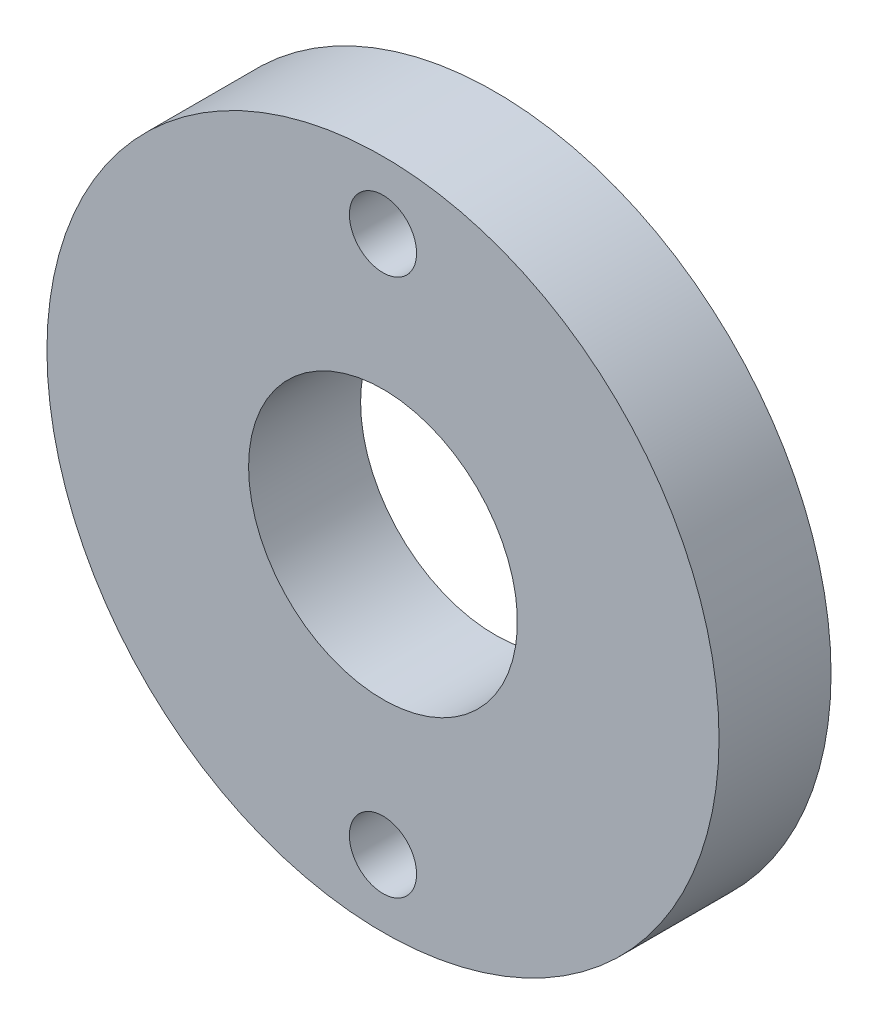
ISO-10303-21;
HEADER;
FILE_DESCRIPTION(('STEP AP214'),'2;1');
FILE_NAME('part.step','',(''),(''),'','','');
FILE_SCHEMA(('AUTOMOTIVE_DESIGN { 1 0 10303 214 1 1 1 1 }'));
ENDSEC;
DATA;
#1=APPLICATION_CONTEXT('core data for automotive mechanical design processes');
#2=APPLICATION_PROTOCOL_DEFINITION('international standard','automotive_design',2000,#1);
#3=PRODUCT_CONTEXT('',#1,'mechanical');
#4=PRODUCT('Part','Part','',(#3));
#5=PRODUCT_RELATED_PRODUCT_CATEGORY('part','',(#4));
#6=PRODUCT_DEFINITION_FORMATION('','',#4);
#7=PRODUCT_DEFINITION_CONTEXT('part definition',#1,'design');
#8=PRODUCT_DEFINITION('design','',#6,#7);
#9=PRODUCT_DEFINITION_SHAPE('','',#8);
#10=(LENGTH_UNIT() NAMED_UNIT(*) SI_UNIT(.MILLI.,.METRE.));
#11=(NAMED_UNIT(*) PLANE_ANGLE_UNIT() SI_UNIT($,.RADIAN.));
#12=(NAMED_UNIT(*) SI_UNIT($,.STERADIAN.) SOLID_ANGLE_UNIT());
#13=UNCERTAINTY_MEASURE_WITH_UNIT(LENGTH_MEASURE(1.E-05),#10,'distance_accuracy_value','');
#14=(GEOMETRIC_REPRESENTATION_CONTEXT(3) GLOBAL_UNCERTAINTY_ASSIGNED_CONTEXT((#13)) GLOBAL_UNIT_ASSIGNED_CONTEXT((#10,
#11,#12)) REPRESENTATION_CONTEXT('',''));
#15=CARTESIAN_POINT('',(0.,0.,0.));
#16=DIRECTION('',(0.,0.,1.));
#17=DIRECTION('',(1.,0.,0.));
#18=AXIS2_PLACEMENT_3D('',#15,#16,#17);
#19=CARTESIAN_POINT('',(259.301545348096,-148.573704322227,-5.00000000000002));
#20=DIRECTION('',(0.,0.,-1.));
#21=DIRECTION('',(-1.,0.,0.));
#22=AXIS2_PLACEMENT_3D('',#19,#20,#21);
#23=PLANE('',#22);
#24=CARTESIAN_POINT('',(259.301545348096,-136.573704322227,-5.00000000000002));
#25=DIRECTION('',(0.,0.,-1.));
#26=DIRECTION('',(-1.,0.,0.));
#27=AXIS2_PLACEMENT_3D('',#24,#25,#26);
#28=CIRCLE('',#27,1.50000000000002);
#29=CARTESIAN_POINT('',(257.801545348096,-136.573704322227,-5.00000000000002));
#30=VERTEX_POINT('',#29);
#31=EDGE_CURVE('E56',#30,#30,#28,.T.);
#32=ORIENTED_EDGE('',*,*,#31,.F.);
#33=EDGE_LOOP('',(#32));
#34=FACE_BOUND('',#33,.T.);
#35=CARTESIAN_POINT('',(259.301545348096,-148.573704322227,-5.00000000000002));
#36=DIRECTION('',(0.,0.,-1.));
#37=DIRECTION('',(-1.,0.,0.));
#38=AXIS2_PLACEMENT_3D('',#35,#36,#37);
#39=CIRCLE('',#38,15.);
#40=CARTESIAN_POINT('',(244.301545348096,-148.573704322227,-5.00000000000002));
#41=VERTEX_POINT('',#40);
#42=EDGE_CURVE('E10',#41,#41,#39,.T.);
#43=ORIENTED_EDGE('',*,*,#42,.T.);
#44=EDGE_LOOP('',(#43));
#45=FACE_BOUND('',#44,.T.);
#46=CARTESIAN_POINT('',(259.301545348096,-148.573704322227,-5.00000000000002));
#47=DIRECTION('',(0.,0.,-1.));
#48=DIRECTION('',(-1.,0.,0.));
#49=AXIS2_PLACEMENT_3D('',#46,#47,#48);
#50=CIRCLE('',#49,5.99999999999999);
#51=CARTESIAN_POINT('',(253.301545348096,-148.573704322227,-5.00000000000002));
#52=VERTEX_POINT('',#51);
#53=EDGE_CURVE('E50',#52,#52,#50,.T.);
#54=ORIENTED_EDGE('',*,*,#53,.F.);
#55=EDGE_LOOP('',(#54));
#56=FACE_BOUND('',#55,.T.);
#57=CARTESIAN_POINT('',(259.301545348096,-160.573704322227,-5.00000000000002));
#58=DIRECTION('',(0.,0.,-1.));
#59=DIRECTION('',(-1.,0.,0.));
#60=AXIS2_PLACEMENT_3D('',#57,#58,#59);
#61=CIRCLE('',#60,1.50000000000002);
#62=CARTESIAN_POINT('',(257.801545348096,-160.573704322227,-5.00000000000002));
#63=VERTEX_POINT('',#62);
#64=EDGE_CURVE('E64',#63,#63,#61,.T.);
#65=ORIENTED_EDGE('',*,*,#64,.F.);
#66=EDGE_LOOP('',(#65));
#67=FACE_BOUND('',#66,.T.);
#68=ADVANCED_FACE('F37',(#34,#45,#56,#67),#23,.T.);
#69=CARTESIAN_POINT('',(259.301545348096,-148.573704322227,0.));
#70=DIRECTION('',(0.,0.,-1.));
#71=DIRECTION('',(-1.,0.,0.));
#72=AXIS2_PLACEMENT_3D('',#69,#70,#71);
#73=PLANE('',#72);
#74=CARTESIAN_POINT('',(259.301545348096,-148.573704322227,0.));
#75=DIRECTION('',(0.,0.,-1.));
#76=DIRECTION('',(-1.,0.,0.));
#77=AXIS2_PLACEMENT_3D('',#74,#75,#76);
#78=CIRCLE('',#77,15.);
#79=CARTESIAN_POINT('',(244.301545348096,-148.573704322227,0.));
#80=VERTEX_POINT('',#79);
#81=EDGE_CURVE('E41',#80,#80,#78,.T.);
#82=ORIENTED_EDGE('',*,*,#81,.F.);
#83=EDGE_LOOP('',(#82));
#84=FACE_BOUND('',#83,.T.);
#85=CARTESIAN_POINT('',(259.301545348096,-148.573704322227,0.));
#86=DIRECTION('',(0.,0.,-1.));
#87=DIRECTION('',(-1.,0.,0.));
#88=AXIS2_PLACEMENT_3D('',#85,#86,#87);
#89=CIRCLE('',#88,5.99999999999999);
#90=CARTESIAN_POINT('',(253.301545348096,-148.573704322227,0.));
#91=VERTEX_POINT('',#90);
#92=EDGE_CURVE('E52',#91,#91,#89,.T.);
#93=ORIENTED_EDGE('',*,*,#92,.T.);
#94=EDGE_LOOP('',(#93));
#95=FACE_BOUND('',#94,.T.);
#96=CARTESIAN_POINT('',(259.301545348096,-136.573704322227,0.));
#97=DIRECTION('',(0.,0.,-1.));
#98=DIRECTION('',(-1.,0.,0.));
#99=AXIS2_PLACEMENT_3D('',#96,#97,#98);
#100=CIRCLE('',#99,1.50000000000002);
#101=CARTESIAN_POINT('',(257.801545348096,-136.573704322227,0.));
#102=VERTEX_POINT('',#101);
#103=EDGE_CURVE('E60',#102,#102,#100,.T.);
#104=ORIENTED_EDGE('',*,*,#103,.T.);
#105=EDGE_LOOP('',(#104));
#106=FACE_BOUND('',#105,.T.);
#107=CARTESIAN_POINT('',(259.301545348096,-160.573704322227,0.));
#108=DIRECTION('',(0.,0.,-1.));
#109=DIRECTION('',(-1.,0.,0.));
#110=AXIS2_PLACEMENT_3D('',#107,#108,#109);
#111=CIRCLE('',#110,1.50000000000002);
#112=CARTESIAN_POINT('',(257.801545348096,-160.573704322227,0.));
#113=VERTEX_POINT('',#112);
#114=EDGE_CURVE('E68',#113,#113,#111,.T.);
#115=ORIENTED_EDGE('',*,*,#114,.T.);
#116=EDGE_LOOP('',(#115));
#117=FACE_BOUND('',#116,.T.);
#118=ADVANCED_FACE('F80',(#84,#95,#106,#117),#73,.F.);
#119=CARTESIAN_POINT('',(259.301545348096,-148.573704322227,-5.00000000000002));
#120=DIRECTION('',(0.,0.,1.));
#121=DIRECTION('',(1.,0.,0.));
#122=AXIS2_PLACEMENT_3D('',#119,#120,#121);
#123=CYLINDRICAL_SURFACE('',#122,15.);
#124=ORIENTED_EDGE('',*,*,#42,.F.);
#125=EDGE_LOOP('',(#124));
#126=FACE_BOUND('',#125,.T.);
#127=ORIENTED_EDGE('',*,*,#81,.T.);
#128=EDGE_LOOP('',(#127));
#129=FACE_BOUND('',#128,.T.);
#130=ADVANCED_FACE('F39',(#126,#129),#123,.T.);
#131=CARTESIAN_POINT('',(259.301545348096,-148.573704322227,-5.00000000000002));
#132=DIRECTION('',(0.,0.,1.));
#133=DIRECTION('',(1.,0.,0.));
#134=AXIS2_PLACEMENT_3D('',#131,#132,#133);
#135=CYLINDRICAL_SURFACE('',#134,5.99999999999999);
#136=ORIENTED_EDGE('',*,*,#53,.T.);
#137=EDGE_LOOP('',(#136));
#138=FACE_BOUND('',#137,.T.);
#139=ORIENTED_EDGE('',*,*,#92,.F.);
#140=EDGE_LOOP('',(#139));
#141=FACE_BOUND('',#140,.T.);
#142=ADVANCED_FACE('F89',(#138,#141),#135,.F.);
#143=CARTESIAN_POINT('',(259.301545348096,-136.573704322227,-5.00000000000002));
#144=DIRECTION('',(0.,0.,1.));
#145=DIRECTION('',(1.,0.,0.));
#146=AXIS2_PLACEMENT_3D('',#143,#144,#145);
#147=CYLINDRICAL_SURFACE('',#146,1.50000000000002);
#148=ORIENTED_EDGE('',*,*,#31,.T.);
#149=EDGE_LOOP('',(#148));
#150=FACE_BOUND('',#149,.T.);
#151=ORIENTED_EDGE('',*,*,#103,.F.);
#152=EDGE_LOOP('',(#151));
#153=FACE_BOUND('',#152,.T.);
#154=ADVANCED_FACE('F92',(#150,#153),#147,.F.);
#155=CARTESIAN_POINT('',(259.301545348096,-160.573704322227,-5.00000000000002));
#156=DIRECTION('',(0.,0.,1.));
#157=DIRECTION('',(1.,0.,0.));
#158=AXIS2_PLACEMENT_3D('',#155,#156,#157);
#159=CYLINDRICAL_SURFACE('',#158,1.50000000000002);
#160=ORIENTED_EDGE('',*,*,#64,.T.);
#161=EDGE_LOOP('',(#160));
#162=FACE_BOUND('',#161,.T.);
#163=ORIENTED_EDGE('',*,*,#114,.F.);
#164=EDGE_LOOP('',(#163));
#165=FACE_BOUND('',#164,.T.);
#166=ADVANCED_FACE('F76',(#162,#165),#159,.F.);
#167=CLOSED_SHELL('',(#68,#118,#130,#142,#154,#166));
#168=MANIFOLD_SOLID_BREP('B2',#167);
#169=ADVANCED_BREP_SHAPE_REPRESENTATION('',(#18,#168),#14);
#170=SHAPE_DEFINITION_REPRESENTATION(#9,#169);
ENDSEC;
END-ISO-10303-21;
